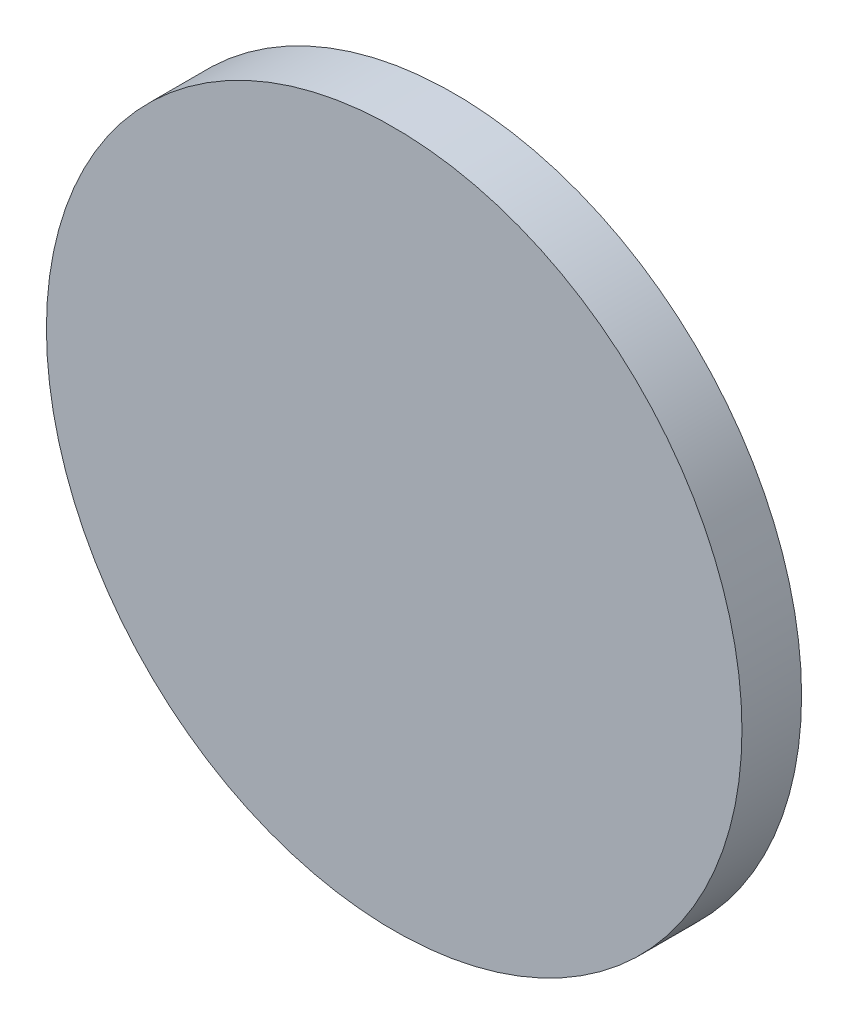
ISO-10303-21;
HEADER;
FILE_DESCRIPTION(('STEP AP214'),'2;1');
FILE_NAME('part.step','',(''),(''),'','','');
FILE_SCHEMA(('AUTOMOTIVE_DESIGN { 1 0 10303 214 1 1 1 1 }'));
ENDSEC;
DATA;
#1=APPLICATION_CONTEXT('core data for automotive mechanical design processes');
#2=APPLICATION_PROTOCOL_DEFINITION('international standard','automotive_design',2000,#1);
#3=PRODUCT_CONTEXT('',#1,'mechanical');
#4=PRODUCT('Part','Part','',(#3));
#5=PRODUCT_RELATED_PRODUCT_CATEGORY('part','',(#4));
#6=PRODUCT_DEFINITION_FORMATION('','',#4);
#7=PRODUCT_DEFINITION_CONTEXT('part definition',#1,'design');
#8=PRODUCT_DEFINITION('design','',#6,#7);
#9=PRODUCT_DEFINITION_SHAPE('','',#8);
#10=(LENGTH_UNIT() NAMED_UNIT(*) SI_UNIT(.MILLI.,.METRE.));
#11=(NAMED_UNIT(*) PLANE_ANGLE_UNIT() SI_UNIT($,.RADIAN.));
#12=(NAMED_UNIT(*) SI_UNIT($,.STERADIAN.) SOLID_ANGLE_UNIT());
#13=UNCERTAINTY_MEASURE_WITH_UNIT(LENGTH_MEASURE(1.E-05),#10,'distance_accuracy_value','');
#14=(GEOMETRIC_REPRESENTATION_CONTEXT(3) GLOBAL_UNCERTAINTY_ASSIGNED_CONTEXT((#13)) GLOBAL_UNIT_ASSIGNED_CONTEXT((#10,
#11,#12)) REPRESENTATION_CONTEXT('',''));
#15=CARTESIAN_POINT('',(0.,0.,0.));
#16=DIRECTION('',(0.,0.,1.));
#17=DIRECTION('',(1.,0.,0.));
#18=AXIS2_PLACEMENT_3D('',#15,#16,#17);
#19=CARTESIAN_POINT('',(1.7653,4.264660006176,0.03429));
#20=DIRECTION('',(0.,0.,1.));
#21=DIRECTION('',(1.,0.,0.));
#22=AXIS2_PLACEMENT_3D('',#19,#20,#21);
#23=PLANE('',#22);
#24=CARTESIAN_POINT('',(1.7653,4.264660006176,0.03429));
#25=DIRECTION('',(0.,0.,1.));
#26=DIRECTION('',(1.,0.,0.));
#27=AXIS2_PLACEMENT_3D('',#24,#25,#26);
#28=CIRCLE('',#27,0.200024667);
#29=CARTESIAN_POINT('',(1.965324667,4.264660006176,0.03429));
#30=VERTEX_POINT('',#29);
#31=EDGE_CURVE('E18',#30,#30,#28,.F.);
#32=ORIENTED_EDGE('',*,*,#31,.F.);
#33=EDGE_LOOP('',(#32));
#34=FACE_BOUND('',#33,.T.);
#35=ADVANCED_FACE('F15',(#34),#23,.T.);
#36=CARTESIAN_POINT('',(1.7653,4.264660006176,0.));
#37=DIRECTION('',(0.,0.,1.));
#38=DIRECTION('',(1.,0.,0.));
#39=AXIS2_PLACEMENT_3D('',#36,#37,#38);
#40=CYLINDRICAL_SURFACE('',#39,0.200024667);
#41=ORIENTED_EDGE('',*,*,#31,.T.);
#42=EDGE_LOOP('',(#41));
#43=FACE_BOUND('',#42,.T.);
#44=CARTESIAN_POINT('',(1.7653,4.264660006176,0.));
#45=DIRECTION('',(0.,0.,1.));
#46=DIRECTION('',(1.,0.,0.));
#47=AXIS2_PLACEMENT_3D('',#44,#45,#46);
#48=CIRCLE('',#47,0.200024667);
#49=CARTESIAN_POINT('',(1.965324667,4.264660006176,0.));
#50=VERTEX_POINT('',#49);
#51=EDGE_CURVE('E10',#50,#50,#48,.F.);
#52=ORIENTED_EDGE('',*,*,#51,.F.);
#53=EDGE_LOOP('',(#52));
#54=FACE_BOUND('',#53,.T.);
#55=ADVANCED_FACE('F27',(#43,#54),#40,.T.);
#56=CARTESIAN_POINT('',(1.7653,4.264660006176,0.));
#57=DIRECTION('',(0.,0.,-1.));
#58=DIRECTION('',(-1.,0.,0.));
#59=AXIS2_PLACEMENT_3D('',#56,#57,#58);
#60=PLANE('',#59);
#61=ORIENTED_EDGE('',*,*,#51,.T.);
#62=EDGE_LOOP('',(#61));
#63=FACE_BOUND('',#62,.T.);
#64=ADVANCED_FACE('F35',(#63),#60,.T.);
#65=CLOSED_SHELL('',(#35,#55,#64));
#66=MANIFOLD_SOLID_BREP('B1',#65);
#67=ADVANCED_BREP_SHAPE_REPRESENTATION('',(#18,#66),#14);
#68=SHAPE_DEFINITION_REPRESENTATION(#9,#67);
ENDSEC;
END-ISO-10303-21;
